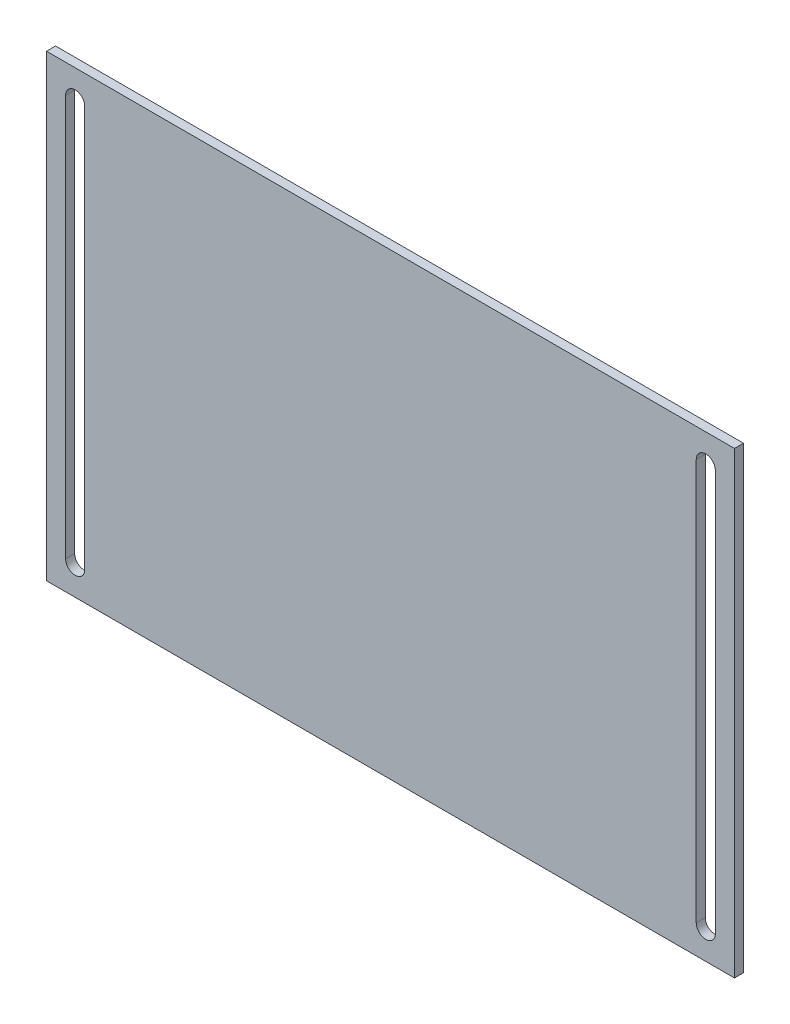
ISO-10303-21;
HEADER;
FILE_DESCRIPTION(('STEP AP214'),'2;1');
FILE_NAME('part.step','',(''),(''),'','','');
FILE_SCHEMA(('AUTOMOTIVE_DESIGN { 1 0 10303 214 1 1 1 1 }'));
ENDSEC;
DATA;
#1=APPLICATION_CONTEXT('core data for automotive mechanical design processes');
#2=APPLICATION_PROTOCOL_DEFINITION('international standard','automotive_design',2000,#1);
#3=PRODUCT_CONTEXT('',#1,'mechanical');
#4=PRODUCT('Part','Part','',(#3));
#5=PRODUCT_RELATED_PRODUCT_CATEGORY('part','',(#4));
#6=PRODUCT_DEFINITION_FORMATION('','',#4);
#7=PRODUCT_DEFINITION_CONTEXT('part definition',#1,'design');
#8=PRODUCT_DEFINITION('design','',#6,#7);
#9=PRODUCT_DEFINITION_SHAPE('','',#8);
#10=(LENGTH_UNIT() NAMED_UNIT(*) SI_UNIT(.MILLI.,.METRE.));
#11=(NAMED_UNIT(*) PLANE_ANGLE_UNIT() SI_UNIT($,.RADIAN.));
#12=(NAMED_UNIT(*) SI_UNIT($,.STERADIAN.) SOLID_ANGLE_UNIT());
#13=UNCERTAINTY_MEASURE_WITH_UNIT(LENGTH_MEASURE(1.E-05),#10,'distance_accuracy_value','');
#14=(GEOMETRIC_REPRESENTATION_CONTEXT(3) GLOBAL_UNCERTAINTY_ASSIGNED_CONTEXT((#13)) GLOBAL_UNIT_ASSIGNED_CONTEXT((#10,
#11,#12)) REPRESENTATION_CONTEXT('',''));
#15=CARTESIAN_POINT('',(0.,0.,0.));
#16=DIRECTION('',(0.,0.,1.));
#17=DIRECTION('',(1.,0.,0.));
#18=AXIS2_PLACEMENT_3D('',#15,#16,#17);
#19=CARTESIAN_POINT('',(0.,0.,3.));
#20=DIRECTION('',(0.,0.,1.));
#21=DIRECTION('',(1.,0.,0.));
#22=AXIS2_PLACEMENT_3D('',#19,#20,#21);
#23=PLANE('',#22);
#24=DIRECTION('',(0.,-1.,0.));
#25=VECTOR('',#24,1.);
#26=CARTESIAN_POINT('',(-114.3,-76.2,3.));
#27=LINE('',#26,#25);
#28=CARTESIAN_POINT('',(-114.3,76.2,3.));
#29=VERTEX_POINT('',#28);
#30=CARTESIAN_POINT('',(-114.3,-76.2,3.));
#31=VERTEX_POINT('',#30);
#32=EDGE_CURVE('E191',#29,#31,#27,.T.);
#33=ORIENTED_EDGE('',*,*,#32,.T.);
#34=DIRECTION('',(1.,0.,0.));
#35=VECTOR('',#34,1.);
#36=CARTESIAN_POINT('',(114.3,-76.2,3.));
#37=LINE('',#36,#35);
#38=CARTESIAN_POINT('',(114.3,-76.2,3.));
#39=VERTEX_POINT('',#38);
#40=EDGE_CURVE('E194',#31,#39,#37,.T.);
#41=ORIENTED_EDGE('',*,*,#40,.T.);
#42=DIRECTION('',(0.,1.,0.));
#43=VECTOR('',#42,1.);
#44=CARTESIAN_POINT('',(114.3,-76.2,3.));
#45=LINE('',#44,#43);
#46=CARTESIAN_POINT('',(114.3,76.2,3.));
#47=VERTEX_POINT('',#46);
#48=EDGE_CURVE('E197',#39,#47,#45,.T.);
#49=ORIENTED_EDGE('',*,*,#48,.T.);
#50=DIRECTION('',(-1.,0.,0.));
#51=VECTOR('',#50,1.);
#52=CARTESIAN_POINT('',(114.3,76.2,3.));
#53=LINE('',#52,#51);
#54=EDGE_CURVE('E199',#47,#29,#53,.T.);
#55=ORIENTED_EDGE('',*,*,#54,.T.);
#56=EDGE_LOOP('',(#33,#41,#49,#55));
#57=FACE_BOUND('',#56,.T.);
#58=DIRECTION('',(0.,-1.,0.));
#59=VECTOR('',#58,1.);
#60=CARTESIAN_POINT('',(-107.95,66.675,3.));
#61=LINE('',#60,#59);
#62=CARTESIAN_POINT('',(-107.95,66.675,3.));
#63=VERTEX_POINT('',#62);
#64=CARTESIAN_POINT('',(-107.95,-66.6750000000001,3.));
#65=VERTEX_POINT('',#64);
#66=EDGE_CURVE('E162',#63,#65,#61,.T.);
#67=ORIENTED_EDGE('',*,*,#66,.F.);
#68=CARTESIAN_POINT('',(-104.775,66.675,3.));
#69=DIRECTION('',(0.,0.,1.));
#70=DIRECTION('',(1.,0.,0.));
#71=AXIS2_PLACEMENT_3D('',#68,#69,#70);
#72=CIRCLE('',#71,3.17500000000001);
#73=CARTESIAN_POINT('',(-101.6,66.675,3.));
#74=VERTEX_POINT('',#73);
#75=EDGE_CURVE('E160',#74,#63,#72,.T.);
#76=ORIENTED_EDGE('',*,*,#75,.F.);
#77=DIRECTION('',(0.,1.,0.));
#78=VECTOR('',#77,1.);
#79=CARTESIAN_POINT('',(-101.6,66.675,3.));
#80=LINE('',#79,#78);
#81=CARTESIAN_POINT('',(-101.6,-66.6750000000001,3.));
#82=VERTEX_POINT('',#81);
#83=EDGE_CURVE('E168',#82,#74,#80,.T.);
#84=ORIENTED_EDGE('',*,*,#83,.F.);
#85=CARTESIAN_POINT('',(-104.775,-66.6750000000001,3.));
#86=DIRECTION('',(0.,0.,1.));
#87=DIRECTION('',(1.,0.,0.));
#88=AXIS2_PLACEMENT_3D('',#85,#86,#87);
#89=CIRCLE('',#88,3.17500000000001);
#90=EDGE_CURVE('E165',#65,#82,#89,.T.);
#91=ORIENTED_EDGE('',*,*,#90,.F.);
#92=EDGE_LOOP('',(#67,#76,#84,#91));
#93=FACE_BOUND('',#92,.T.);
#94=DIRECTION('',(0.,-1.,0.));
#95=VECTOR('',#94,1.);
#96=CARTESIAN_POINT('',(101.6,66.675,3.));
#97=LINE('',#96,#95);
#98=CARTESIAN_POINT('',(101.6,66.675,3.));
#99=VERTEX_POINT('',#98);
#100=CARTESIAN_POINT('',(101.6,-66.675,3.));
#101=VERTEX_POINT('',#100);
#102=EDGE_CURVE('E132',#99,#101,#97,.T.);
#103=ORIENTED_EDGE('',*,*,#102,.F.);
#104=CARTESIAN_POINT('',(104.775,66.675,3.));
#105=DIRECTION('',(0.,0.,1.));
#106=DIRECTION('',(1.,0.,0.));
#107=AXIS2_PLACEMENT_3D('',#104,#105,#106);
#108=CIRCLE('',#107,3.17499999999996);
#109=CARTESIAN_POINT('',(107.95,66.675,3.));
#110=VERTEX_POINT('',#109);
#111=EDGE_CURVE('E124',#110,#99,#108,.T.);
#112=ORIENTED_EDGE('',*,*,#111,.F.);
#113=DIRECTION('',(0.,1.,0.));
#114=VECTOR('',#113,1.);
#115=CARTESIAN_POINT('',(107.95,66.675,3.));
#116=LINE('',#115,#114);
#117=CARTESIAN_POINT('',(107.95,-66.675,3.));
#118=VERTEX_POINT('',#117);
#119=EDGE_CURVE('E146',#118,#110,#116,.T.);
#120=ORIENTED_EDGE('',*,*,#119,.F.);
#121=CARTESIAN_POINT('',(104.775,-66.675,3.));
#122=DIRECTION('',(0.,0.,1.));
#123=DIRECTION('',(1.,0.,0.));
#124=AXIS2_PLACEMENT_3D('',#121,#122,#123);
#125=CIRCLE('',#124,3.17499999999996);
#126=EDGE_CURVE('E144',#101,#118,#125,.T.);
#127=ORIENTED_EDGE('',*,*,#126,.F.);
#128=EDGE_LOOP('',(#103,#112,#120,#127));
#129=FACE_BOUND('',#128,.T.);
#130=ADVANCED_FACE('F35',(#57,#93,#129),#23,.T.);
#131=CARTESIAN_POINT('',(0.,0.,0.));
#132=DIRECTION('',(0.,0.,1.));
#133=DIRECTION('',(1.,0.,0.));
#134=AXIS2_PLACEMENT_3D('',#131,#132,#133);
#135=PLANE('',#134);
#136=CARTESIAN_POINT('',(-104.775,66.675,0.));
#137=DIRECTION('',(0.,0.,1.));
#138=DIRECTION('',(1.,0.,0.));
#139=AXIS2_PLACEMENT_3D('',#136,#137,#138);
#140=CIRCLE('',#139,3.17500000000001);
#141=CARTESIAN_POINT('',(-101.6,66.675,0.));
#142=VERTEX_POINT('',#141);
#143=CARTESIAN_POINT('',(-107.95,66.675,0.));
#144=VERTEX_POINT('',#143);
#145=EDGE_CURVE('E140',#142,#144,#140,.T.);
#146=ORIENTED_EDGE('',*,*,#145,.T.);
#147=DIRECTION('',(0.,-1.,0.));
#148=VECTOR('',#147,1.);
#149=CARTESIAN_POINT('',(-107.95,66.675,0.));
#150=LINE('',#149,#148);
#151=CARTESIAN_POINT('',(-107.95,-66.6750000000001,0.));
#152=VERTEX_POINT('',#151);
#153=EDGE_CURVE('E173',#144,#152,#150,.T.);
#154=ORIENTED_EDGE('',*,*,#153,.T.);
#155=CARTESIAN_POINT('',(-104.775,-66.6750000000001,0.));
#156=DIRECTION('',(0.,0.,1.));
#157=DIRECTION('',(1.,0.,0.));
#158=AXIS2_PLACEMENT_3D('',#155,#156,#157);
#159=CIRCLE('',#158,3.17500000000001);
#160=CARTESIAN_POINT('',(-101.6,-66.6750000000001,0.));
#161=VERTEX_POINT('',#160);
#162=EDGE_CURVE('E176',#152,#161,#159,.T.);
#163=ORIENTED_EDGE('',*,*,#162,.T.);
#164=DIRECTION('',(0.,1.,0.));
#165=VECTOR('',#164,1.);
#166=CARTESIAN_POINT('',(-101.6,66.675,0.));
#167=LINE('',#166,#165);
#168=EDGE_CURVE('E163',#161,#142,#167,.T.);
#169=ORIENTED_EDGE('',*,*,#168,.T.);
#170=EDGE_LOOP('',(#146,#154,#163,#169));
#171=FACE_BOUND('',#170,.T.);
#172=DIRECTION('',(0.,-1.,0.));
#173=VECTOR('',#172,1.);
#174=CARTESIAN_POINT('',(-114.3,-76.2,0.));
#175=LINE('',#174,#173);
#176=CARTESIAN_POINT('',(-114.3,76.2,0.));
#177=VERTEX_POINT('',#176);
#178=CARTESIAN_POINT('',(-114.3,-76.2,0.));
#179=VERTEX_POINT('',#178);
#180=EDGE_CURVE('E190',#177,#179,#175,.T.);
#181=ORIENTED_EDGE('',*,*,#180,.F.);
#182=DIRECTION('',(-1.,0.,0.));
#183=VECTOR('',#182,1.);
#184=CARTESIAN_POINT('',(114.3,76.2,0.));
#185=LINE('',#184,#183);
#186=CARTESIAN_POINT('',(114.3,76.2,0.));
#187=VERTEX_POINT('',#186);
#188=EDGE_CURVE('E195',#187,#177,#185,.T.);
#189=ORIENTED_EDGE('',*,*,#188,.F.);
#190=DIRECTION('',(0.,1.,0.));
#191=VECTOR('',#190,1.);
#192=CARTESIAN_POINT('',(114.3,-76.2,0.));
#193=LINE('',#192,#191);
#194=CARTESIAN_POINT('',(114.3,-76.2,0.));
#195=VERTEX_POINT('',#194);
#196=EDGE_CURVE('E206',#195,#187,#193,.T.);
#197=ORIENTED_EDGE('',*,*,#196,.F.);
#198=DIRECTION('',(1.,0.,0.));
#199=VECTOR('',#198,1.);
#200=CARTESIAN_POINT('',(114.3,-76.2,0.));
#201=LINE('',#200,#199);
#202=EDGE_CURVE('E204',#179,#195,#201,.T.);
#203=ORIENTED_EDGE('',*,*,#202,.F.);
#204=EDGE_LOOP('',(#181,#189,#197,#203));
#205=FACE_BOUND('',#204,.T.);
#206=CARTESIAN_POINT('',(104.775,66.675,0.));
#207=DIRECTION('',(0.,0.,1.));
#208=DIRECTION('',(1.,0.,0.));
#209=AXIS2_PLACEMENT_3D('',#206,#207,#208);
#210=CIRCLE('',#209,3.17499999999996);
#211=CARTESIAN_POINT('',(107.95,66.675,0.));
#212=VERTEX_POINT('',#211);
#213=CARTESIAN_POINT('',(101.6,66.675,0.));
#214=VERTEX_POINT('',#213);
#215=EDGE_CURVE('E58',#212,#214,#210,.T.);
#216=ORIENTED_EDGE('',*,*,#215,.T.);
#217=DIRECTION('',(0.,-1.,0.));
#218=VECTOR('',#217,1.);
#219=CARTESIAN_POINT('',(101.6,66.675,0.));
#220=LINE('',#219,#218);
#221=CARTESIAN_POINT('',(101.6,-66.675,0.));
#222=VERTEX_POINT('',#221);
#223=EDGE_CURVE('E139',#214,#222,#220,.T.);
#224=ORIENTED_EDGE('',*,*,#223,.T.);
#225=CARTESIAN_POINT('',(104.775,-66.675,0.));
#226=DIRECTION('',(0.,0.,1.));
#227=DIRECTION('',(1.,0.,0.));
#228=AXIS2_PLACEMENT_3D('',#225,#226,#227);
#229=CIRCLE('',#228,3.17499999999996);
#230=CARTESIAN_POINT('',(107.95,-66.675,0.));
#231=VERTEX_POINT('',#230);
#232=EDGE_CURVE('E152',#222,#231,#229,.T.);
#233=ORIENTED_EDGE('',*,*,#232,.T.);
#234=DIRECTION('',(0.,1.,0.));
#235=VECTOR('',#234,1.);
#236=CARTESIAN_POINT('',(107.95,66.675,0.));
#237=LINE('',#236,#235);
#238=EDGE_CURVE('E133',#231,#212,#237,.T.);
#239=ORIENTED_EDGE('',*,*,#238,.T.);
#240=EDGE_LOOP('',(#216,#224,#233,#239));
#241=FACE_BOUND('',#240,.T.);
#242=ADVANCED_FACE('F224',(#171,#205,#241),#135,.F.);
#243=CARTESIAN_POINT('',(-114.3,-76.2,3.));
#244=DIRECTION('',(1.,0.,0.));
#245=DIRECTION('',(0.,1.,0.));
#246=AXIS2_PLACEMENT_3D('',#243,#244,#245);
#247=PLANE('',#246);
#248=ORIENTED_EDGE('',*,*,#180,.T.);
#249=DIRECTION('',(0.,0.,-1.));
#250=VECTOR('',#249,1.);
#251=CARTESIAN_POINT('',(-114.3,-76.2,3.));
#252=LINE('',#251,#250);
#253=EDGE_CURVE('E11',#31,#179,#252,.T.);
#254=ORIENTED_EDGE('',*,*,#253,.F.);
#255=ORIENTED_EDGE('',*,*,#32,.F.);
#256=DIRECTION('',(0.,0.,-1.));
#257=VECTOR('',#256,1.);
#258=CARTESIAN_POINT('',(-114.3,76.2,3.));
#259=LINE('',#258,#257);
#260=EDGE_CURVE('E201',#29,#177,#259,.T.);
#261=ORIENTED_EDGE('',*,*,#260,.T.);
#262=EDGE_LOOP('',(#248,#254,#255,#261));
#263=FACE_BOUND('',#262,.T.);
#264=ADVANCED_FACE('F37',(#263),#247,.F.);
#265=CARTESIAN_POINT('',(114.3,-76.2,3.));
#266=DIRECTION('',(0.,1.,0.));
#267=DIRECTION('',(-1.,0.,0.));
#268=AXIS2_PLACEMENT_3D('',#265,#266,#267);
#269=PLANE('',#268);
#270=ORIENTED_EDGE('',*,*,#202,.T.);
#271=DIRECTION('',(0.,0.,-1.));
#272=VECTOR('',#271,1.);
#273=CARTESIAN_POINT('',(114.3,-76.2,3.));
#274=LINE('',#273,#272);
#275=EDGE_CURVE('E43',#39,#195,#274,.T.);
#276=ORIENTED_EDGE('',*,*,#275,.F.);
#277=ORIENTED_EDGE('',*,*,#40,.F.);
#278=ORIENTED_EDGE('',*,*,#253,.T.);
#279=EDGE_LOOP('',(#270,#276,#277,#278));
#280=FACE_BOUND('',#279,.T.);
#281=ADVANCED_FACE('F235',(#280),#269,.F.);
#282=CARTESIAN_POINT('',(114.3,-76.2,3.));
#283=DIRECTION('',(-1.,0.,0.));
#284=DIRECTION('',(0.,0.,1.));
#285=AXIS2_PLACEMENT_3D('',#282,#283,#284);
#286=PLANE('',#285);
#287=ORIENTED_EDGE('',*,*,#196,.T.);
#288=DIRECTION('',(0.,0.,-1.));
#289=VECTOR('',#288,1.);
#290=CARTESIAN_POINT('',(114.3,76.2,3.));
#291=LINE('',#290,#289);
#292=EDGE_CURVE('E211',#47,#187,#291,.T.);
#293=ORIENTED_EDGE('',*,*,#292,.F.);
#294=ORIENTED_EDGE('',*,*,#48,.F.);
#295=ORIENTED_EDGE('',*,*,#275,.T.);
#296=EDGE_LOOP('',(#287,#293,#294,#295));
#297=FACE_BOUND('',#296,.T.);
#298=ADVANCED_FACE('F218',(#297),#286,.F.);
#299=CARTESIAN_POINT('',(114.3,76.2,3.));
#300=DIRECTION('',(0.,-1.,0.));
#301=DIRECTION('',(1.,0.,0.));
#302=AXIS2_PLACEMENT_3D('',#299,#300,#301);
#303=PLANE('',#302);
#304=ORIENTED_EDGE('',*,*,#188,.T.);
#305=ORIENTED_EDGE('',*,*,#260,.F.);
#306=ORIENTED_EDGE('',*,*,#54,.F.);
#307=ORIENTED_EDGE('',*,*,#292,.T.);
#308=EDGE_LOOP('',(#304,#305,#306,#307));
#309=FACE_BOUND('',#308,.T.);
#310=ADVANCED_FACE('F228',(#309),#303,.F.);
#311=CARTESIAN_POINT('',(-104.775,66.675,3.));
#312=DIRECTION('',(0.,0.,-1.));
#313=DIRECTION('',(-1.,0.,0.));
#314=AXIS2_PLACEMENT_3D('',#311,#312,#313);
#315=CYLINDRICAL_SURFACE('',#314,3.17500000000001);
#316=ORIENTED_EDGE('',*,*,#145,.F.);
#317=DIRECTION('',(0.,0.,-1.));
#318=VECTOR('',#317,1.);
#319=CARTESIAN_POINT('',(-101.6,66.675,3.));
#320=LINE('',#319,#318);
#321=EDGE_CURVE('E170',#74,#142,#320,.T.);
#322=ORIENTED_EDGE('',*,*,#321,.F.);
#323=ORIENTED_EDGE('',*,*,#75,.T.);
#324=DIRECTION('',(0.,0.,-1.));
#325=VECTOR('',#324,1.);
#326=CARTESIAN_POINT('',(-107.95,66.675,3.));
#327=LINE('',#326,#325);
#328=EDGE_CURVE('E187',#63,#144,#327,.T.);
#329=ORIENTED_EDGE('',*,*,#328,.T.);
#330=EDGE_LOOP('',(#316,#322,#323,#329));
#331=FACE_BOUND('',#330,.T.);
#332=ADVANCED_FACE('F250',(#331),#315,.F.);
#333=CARTESIAN_POINT('',(-107.95,66.675,3.));
#334=DIRECTION('',(1.,0.,0.));
#335=DIRECTION('',(0.,1.,0.));
#336=AXIS2_PLACEMENT_3D('',#333,#334,#335);
#337=PLANE('',#336);
#338=ORIENTED_EDGE('',*,*,#153,.F.);
#339=ORIENTED_EDGE('',*,*,#328,.F.);
#340=ORIENTED_EDGE('',*,*,#66,.T.);
#341=DIRECTION('',(0.,0.,-1.));
#342=VECTOR('',#341,1.);
#343=CARTESIAN_POINT('',(-107.95,-66.6750000000001,3.));
#344=LINE('',#343,#342);
#345=EDGE_CURVE('E185',#65,#152,#344,.T.);
#346=ORIENTED_EDGE('',*,*,#345,.T.);
#347=EDGE_LOOP('',(#338,#339,#340,#346));
#348=FACE_BOUND('',#347,.T.);
#349=ADVANCED_FACE('F257',(#348),#337,.T.);
#350=CARTESIAN_POINT('',(-104.775,-66.6750000000001,3.));
#351=DIRECTION('',(0.,0.,-1.));
#352=DIRECTION('',(-1.,0.,0.));
#353=AXIS2_PLACEMENT_3D('',#350,#351,#352);
#354=CYLINDRICAL_SURFACE('',#353,3.17500000000001);
#355=ORIENTED_EDGE('',*,*,#162,.F.);
#356=ORIENTED_EDGE('',*,*,#345,.F.);
#357=ORIENTED_EDGE('',*,*,#90,.T.);
#358=DIRECTION('',(0.,0.,-1.));
#359=VECTOR('',#358,1.);
#360=CARTESIAN_POINT('',(-101.6,-66.6750000000001,3.));
#361=LINE('',#360,#359);
#362=EDGE_CURVE('E183',#82,#161,#361,.T.);
#363=ORIENTED_EDGE('',*,*,#362,.T.);
#364=EDGE_LOOP('',(#355,#356,#357,#363));
#365=FACE_BOUND('',#364,.T.);
#366=ADVANCED_FACE('F262',(#365),#354,.F.);
#367=CARTESIAN_POINT('',(-101.6,66.675,3.));
#368=DIRECTION('',(-1.,0.,0.));
#369=DIRECTION('',(0.,-1.,0.));
#370=AXIS2_PLACEMENT_3D('',#367,#368,#369);
#371=PLANE('',#370);
#372=ORIENTED_EDGE('',*,*,#168,.F.);
#373=ORIENTED_EDGE('',*,*,#362,.F.);
#374=ORIENTED_EDGE('',*,*,#83,.T.);
#375=ORIENTED_EDGE('',*,*,#321,.T.);
#376=EDGE_LOOP('',(#372,#373,#374,#375));
#377=FACE_BOUND('',#376,.T.);
#378=ADVANCED_FACE('F269',(#377),#371,.T.);
#379=CARTESIAN_POINT('',(104.775,66.675,3.));
#380=DIRECTION('',(0.,0.,-1.));
#381=DIRECTION('',(-1.,0.,0.));
#382=AXIS2_PLACEMENT_3D('',#379,#380,#381);
#383=CYLINDRICAL_SURFACE('',#382,3.17499999999996);
#384=ORIENTED_EDGE('',*,*,#215,.F.);
#385=DIRECTION('',(0.,0.,-1.));
#386=VECTOR('',#385,1.);
#387=CARTESIAN_POINT('',(107.95,66.675,3.));
#388=LINE('',#387,#386);
#389=EDGE_CURVE('E128',#110,#212,#388,.T.);
#390=ORIENTED_EDGE('',*,*,#389,.F.);
#391=ORIENTED_EDGE('',*,*,#111,.T.);
#392=DIRECTION('',(0.,0.,-1.));
#393=VECTOR('',#392,1.);
#394=CARTESIAN_POINT('',(101.6,66.675,3.));
#395=LINE('',#394,#393);
#396=EDGE_CURVE('E127',#99,#214,#395,.T.);
#397=ORIENTED_EDGE('',*,*,#396,.T.);
#398=EDGE_LOOP('',(#384,#390,#391,#397));
#399=FACE_BOUND('',#398,.T.);
#400=ADVANCED_FACE('F126',(#399),#383,.F.);
#401=CARTESIAN_POINT('',(101.6,66.675,3.));
#402=DIRECTION('',(1.,0.,0.));
#403=DIRECTION('',(0.,1.,0.));
#404=AXIS2_PLACEMENT_3D('',#401,#402,#403);
#405=PLANE('',#404);
#406=ORIENTED_EDGE('',*,*,#223,.F.);
#407=ORIENTED_EDGE('',*,*,#396,.F.);
#408=ORIENTED_EDGE('',*,*,#102,.T.);
#409=DIRECTION('',(0.,0.,-1.));
#410=VECTOR('',#409,1.);
#411=CARTESIAN_POINT('',(101.6,-66.675,3.));
#412=LINE('',#411,#410);
#413=EDGE_CURVE('E141',#101,#222,#412,.T.);
#414=ORIENTED_EDGE('',*,*,#413,.T.);
#415=EDGE_LOOP('',(#406,#407,#408,#414));
#416=FACE_BOUND('',#415,.T.);
#417=ADVANCED_FACE('F136',(#416),#405,.T.);
#418=CARTESIAN_POINT('',(104.775,-66.675,3.));
#419=DIRECTION('',(0.,0.,-1.));
#420=DIRECTION('',(-1.,0.,0.));
#421=AXIS2_PLACEMENT_3D('',#418,#419,#420);
#422=CYLINDRICAL_SURFACE('',#421,3.17499999999996);
#423=ORIENTED_EDGE('',*,*,#232,.F.);
#424=ORIENTED_EDGE('',*,*,#413,.F.);
#425=ORIENTED_EDGE('',*,*,#126,.T.);
#426=DIRECTION('',(0.,0.,-1.));
#427=VECTOR('',#426,1.);
#428=CARTESIAN_POINT('',(107.95,-66.675,3.));
#429=LINE('',#428,#427);
#430=EDGE_CURVE('E50',#118,#231,#429,.T.);
#431=ORIENTED_EDGE('',*,*,#430,.T.);
#432=EDGE_LOOP('',(#423,#424,#425,#431));
#433=FACE_BOUND('',#432,.T.);
#434=ADVANCED_FACE('F287',(#433),#422,.F.);
#435=CARTESIAN_POINT('',(107.95,66.675,3.));
#436=DIRECTION('',(-1.,0.,0.));
#437=DIRECTION('',(0.,-1.,0.));
#438=AXIS2_PLACEMENT_3D('',#435,#436,#437);
#439=PLANE('',#438);
#440=ORIENTED_EDGE('',*,*,#238,.F.);
#441=ORIENTED_EDGE('',*,*,#430,.F.);
#442=ORIENTED_EDGE('',*,*,#119,.T.);
#443=ORIENTED_EDGE('',*,*,#389,.T.);
#444=EDGE_LOOP('',(#440,#441,#442,#443));
#445=FACE_BOUND('',#444,.T.);
#446=ADVANCED_FACE('F290',(#445),#439,.T.);
#447=CLOSED_SHELL('',(#130,#242,#264,#281,#298,#310,#332,#349,#366,#378,#400,#417,#434,#446));
#448=MANIFOLD_SOLID_BREP('B2',#447);
#449=ADVANCED_BREP_SHAPE_REPRESENTATION('',(#18,#448),#14);
#450=SHAPE_DEFINITION_REPRESENTATION(#9,#449);
ENDSEC;
END-ISO-10303-21;
